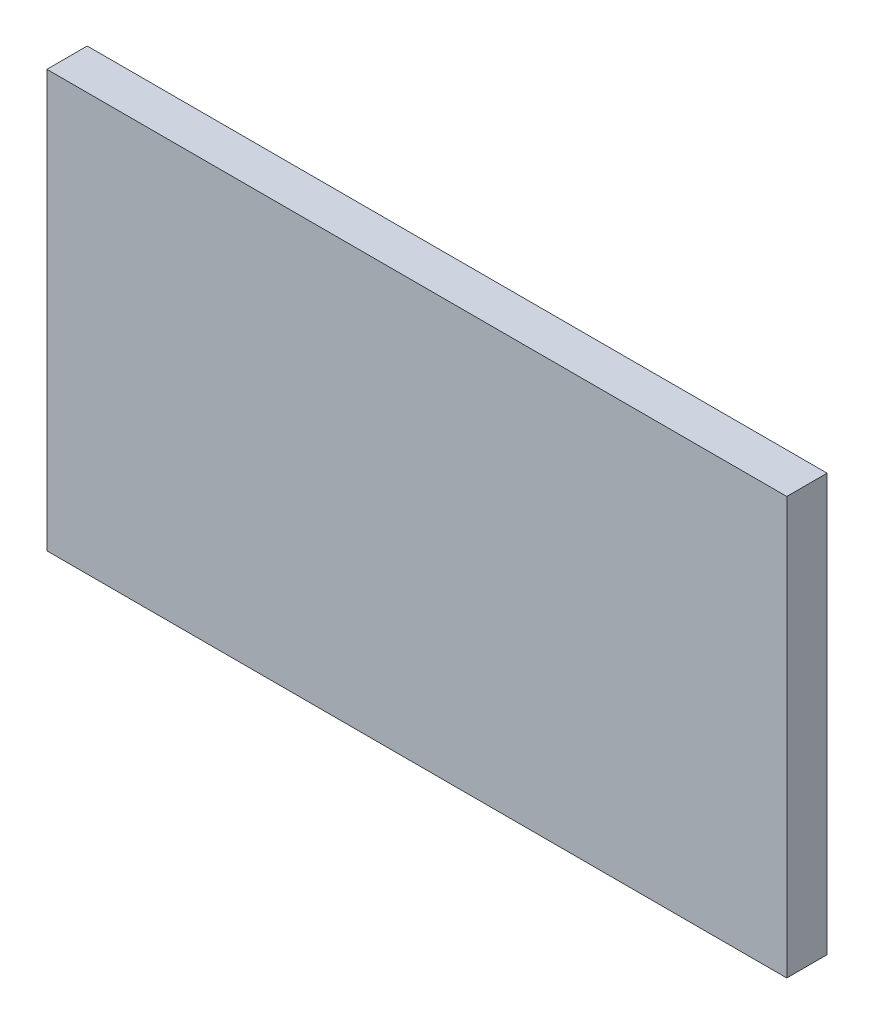
ISO-10303-21;
HEADER;
FILE_DESCRIPTION(('STEP AP214'),'2;1');
FILE_NAME('part.step','',(''),(''),'','','');
FILE_SCHEMA(('AUTOMOTIVE_DESIGN { 1 0 10303 214 1 1 1 1 }'));
ENDSEC;
DATA;
#1=APPLICATION_CONTEXT('core data for automotive mechanical design processes');
#2=APPLICATION_PROTOCOL_DEFINITION('international standard','automotive_design',2000,#1);
#3=PRODUCT_CONTEXT('',#1,'mechanical');
#4=PRODUCT('Part','Part','',(#3));
#5=PRODUCT_RELATED_PRODUCT_CATEGORY('part','',(#4));
#6=PRODUCT_DEFINITION_FORMATION('','',#4);
#7=PRODUCT_DEFINITION_CONTEXT('part definition',#1,'design');
#8=PRODUCT_DEFINITION('design','',#6,#7);
#9=PRODUCT_DEFINITION_SHAPE('','',#8);
#10=(LENGTH_UNIT() NAMED_UNIT(*) SI_UNIT(.MILLI.,.METRE.));
#11=(NAMED_UNIT(*) PLANE_ANGLE_UNIT() SI_UNIT($,.RADIAN.));
#12=(NAMED_UNIT(*) SI_UNIT($,.STERADIAN.) SOLID_ANGLE_UNIT());
#13=UNCERTAINTY_MEASURE_WITH_UNIT(LENGTH_MEASURE(1.E-05),#10,'distance_accuracy_value','');
#14=(GEOMETRIC_REPRESENTATION_CONTEXT(3) GLOBAL_UNCERTAINTY_ASSIGNED_CONTEXT((#13)) GLOBAL_UNIT_ASSIGNED_CONTEXT((#10,
#11,#12)) REPRESENTATION_CONTEXT('',''));
#15=CARTESIAN_POINT('',(0.,0.,0.));
#16=DIRECTION('',(0.,0.,1.));
#17=DIRECTION('',(1.,0.,0.));
#18=AXIS2_PLACEMENT_3D('',#15,#16,#17);
#19=CARTESIAN_POINT('',(106.820407157562,-92.2996991032223,0.762000000007923));
#20=DIRECTION('',(1.,0.,0.));
#21=DIRECTION('',(0.,1.,0.));
#22=AXIS2_PLACEMENT_3D('',#19,#20,#21);
#23=PLANE('',#22);
#24=DIRECTION('',(0.,-1.,0.));
#25=VECTOR('',#24,1.);
#26=CARTESIAN_POINT('',(106.820407157562,-92.299699103209,1.77635683940025E-12));
#27=LINE('',#26,#25);
#28=CARTESIAN_POINT('',(106.820407157562,-84.4256991032124,5.32907051820075E-12));
#29=VERTEX_POINT('',#28);
#30=CARTESIAN_POINT('',(106.820407157562,-92.299699103209,1.77635683940025E-12));
#31=VERTEX_POINT('',#30);
#32=EDGE_CURVE('E97',#29,#31,#27,.T.);
#33=ORIENTED_EDGE('',*,*,#32,.T.);
#34=DIRECTION('',(0.,0.,-1.));
#35=VECTOR('',#34,1.);
#36=CARTESIAN_POINT('',(106.820407157562,-92.2996991032223,0.762000000007923));
#37=LINE('',#36,#35);
#38=CARTESIAN_POINT('',(106.820407157562,-92.2996991032223,0.762000000007923));
#39=VERTEX_POINT('',#38);
#40=EDGE_CURVE('E11',#39,#31,#37,.T.);
#41=ORIENTED_EDGE('',*,*,#40,.F.);
#42=DIRECTION('',(0.,-1.,0.));
#43=VECTOR('',#42,1.);
#44=CARTESIAN_POINT('',(106.820407157562,-92.2996991032223,0.762000000007923));
#45=LINE('',#44,#43);
#46=CARTESIAN_POINT('',(106.820407157562,-84.4256991032062,0.761999999999929));
#47=VERTEX_POINT('',#46);
#48=EDGE_CURVE('E85',#47,#39,#45,.T.);
#49=ORIENTED_EDGE('',*,*,#48,.F.);
#50=DIRECTION('',(0.,0.,-1.));
#51=VECTOR('',#50,1.);
#52=CARTESIAN_POINT('',(106.820407157562,-84.4256991032062,0.761999999999929));
#53=LINE('',#52,#51);
#54=EDGE_CURVE('E93',#47,#29,#53,.T.);
#55=ORIENTED_EDGE('',*,*,#54,.T.);
#56=EDGE_LOOP('',(#33,#41,#49,#55));
#57=FACE_BOUND('',#56,.T.);
#58=ADVANCED_FACE('F34',(#57),#23,.F.);
#59=CARTESIAN_POINT('',(120.790407157562,-92.2996991032135,0.762000000003482));
#60=DIRECTION('',(0.,1.,0.));
#61=DIRECTION('',(0.,0.,1.));
#62=AXIS2_PLACEMENT_3D('',#59,#60,#61);
#63=PLANE('',#62);
#64=DIRECTION('',(1.,0.,0.));
#65=VECTOR('',#64,1.);
#66=CARTESIAN_POINT('',(120.790407157562,-92.2996991032099,8.88178419700125E-13));
#67=LINE('',#66,#65);
#68=CARTESIAN_POINT('',(120.790407157562,-92.2996991032099,8.88178419700125E-13));
#69=VERTEX_POINT('',#68);
#70=EDGE_CURVE('E89',#31,#69,#67,.T.);
#71=ORIENTED_EDGE('',*,*,#70,.T.);
#72=DIRECTION('',(0.,0.,-1.));
#73=VECTOR('',#72,1.);
#74=CARTESIAN_POINT('',(120.790407157562,-92.2996991032135,0.762000000003482));
#75=LINE('',#74,#73);
#76=CARTESIAN_POINT('',(120.790407157562,-92.2996991032135,0.762000000003482));
#77=VERTEX_POINT('',#76);
#78=EDGE_CURVE('E42',#77,#69,#75,.T.);
#79=ORIENTED_EDGE('',*,*,#78,.F.);
#80=DIRECTION('',(1.,0.,0.));
#81=VECTOR('',#80,1.);
#82=CARTESIAN_POINT('',(120.790407157562,-92.2996991032135,0.762000000003482));
#83=LINE('',#82,#81);
#84=EDGE_CURVE('E80',#39,#77,#83,.T.);
#85=ORIENTED_EDGE('',*,*,#84,.F.);
#86=ORIENTED_EDGE('',*,*,#40,.T.);
#87=EDGE_LOOP('',(#71,#79,#85,#86));
#88=FACE_BOUND('',#87,.T.);
#89=ADVANCED_FACE('F88',(#88),#63,.F.);
#90=CARTESIAN_POINT('',(120.790407157562,-92.2996991032135,0.762000000003482));
#91=DIRECTION('',(-1.,0.,0.));
#92=DIRECTION('',(0.,0.,1.));
#93=AXIS2_PLACEMENT_3D('',#90,#91,#92);
#94=PLANE('',#93);
#95=DIRECTION('',(0.,1.,0.));
#96=VECTOR('',#95,1.);
#97=CARTESIAN_POINT('',(120.790407157562,-92.2996991032099,8.88178419700125E-13));
#98=LINE('',#97,#96);
#99=CARTESIAN_POINT('',(120.790407157562,-84.4256991032124,5.32907051820075E-12));
#100=VERTEX_POINT('',#99);
#101=EDGE_CURVE('E67',#69,#100,#98,.T.);
#102=ORIENTED_EDGE('',*,*,#101,.T.);
#103=DIRECTION('',(0.,0.,-1.));
#104=VECTOR('',#103,1.);
#105=CARTESIAN_POINT('',(120.790407157562,-84.4256991032035,0.762000000000818));
#106=LINE('',#105,#104);
#107=CARTESIAN_POINT('',(120.790407157562,-84.4256991032035,0.762000000000818));
#108=VERTEX_POINT('',#107);
#109=EDGE_CURVE('E90',#108,#100,#106,.T.);
#110=ORIENTED_EDGE('',*,*,#109,.F.);
#111=DIRECTION('',(0.,1.,0.));
#112=VECTOR('',#111,1.);
#113=CARTESIAN_POINT('',(120.790407157562,-92.2996991032135,0.762000000003482));
#114=LINE('',#113,#112);
#115=EDGE_CURVE('E83',#77,#108,#114,.T.);
#116=ORIENTED_EDGE('',*,*,#115,.F.);
#117=ORIENTED_EDGE('',*,*,#78,.T.);
#118=EDGE_LOOP('',(#102,#110,#116,#117));
#119=FACE_BOUND('',#118,.T.);
#120=ADVANCED_FACE('F91',(#119),#94,.F.);
#121=CARTESIAN_POINT('',(120.790407157562,-84.4256991032035,0.762000000000818));
#122=DIRECTION('',(0.,-1.,0.));
#123=DIRECTION('',(0.,0.,-1.));
#124=AXIS2_PLACEMENT_3D('',#121,#122,#123);
#125=PLANE('',#124);
#126=DIRECTION('',(-1.,0.,0.));
#127=VECTOR('',#126,1.);
#128=CARTESIAN_POINT('',(120.790407157562,-84.4256991032124,5.32907051820075E-12));
#129=LINE('',#128,#127);
#130=EDGE_CURVE('E73',#100,#29,#129,.T.);
#131=ORIENTED_EDGE('',*,*,#130,.T.);
#132=ORIENTED_EDGE('',*,*,#54,.F.);
#133=DIRECTION('',(-1.,0.,0.));
#134=VECTOR('',#133,1.);
#135=CARTESIAN_POINT('',(120.790407157562,-84.4256991032035,0.762000000000818));
#136=LINE('',#135,#134);
#137=EDGE_CURVE('E50',#108,#47,#136,.T.);
#138=ORIENTED_EDGE('',*,*,#137,.F.);
#139=ORIENTED_EDGE('',*,*,#109,.T.);
#140=EDGE_LOOP('',(#131,#132,#138,#139));
#141=FACE_BOUND('',#140,.T.);
#142=ADVANCED_FACE('F104',(#141),#125,.F.);
#143=CARTESIAN_POINT('',(0.,-6.66133814775094E-13,0.761999999996377));
#144=DIRECTION('',(0.,0.,1.));
#145=DIRECTION('',(1.,0.,0.));
#146=AXIS2_PLACEMENT_3D('',#143,#144,#145);
#147=PLANE('',#146);
#148=ORIENTED_EDGE('',*,*,#48,.T.);
#149=ORIENTED_EDGE('',*,*,#84,.T.);
#150=ORIENTED_EDGE('',*,*,#115,.T.);
#151=ORIENTED_EDGE('',*,*,#137,.T.);
#152=EDGE_LOOP('',(#148,#149,#150,#151));
#153=FACE_BOUND('',#152,.T.);
#154=ADVANCED_FACE('F81',(#153),#147,.T.);
#155=CARTESIAN_POINT('',(0.,0.,0.));
#156=DIRECTION('',(0.,0.,1.));
#157=DIRECTION('',(1.,0.,0.));
#158=AXIS2_PLACEMENT_3D('',#155,#156,#157);
#159=PLANE('',#158);
#160=ORIENTED_EDGE('',*,*,#32,.F.);
#161=ORIENTED_EDGE('',*,*,#130,.F.);
#162=ORIENTED_EDGE('',*,*,#101,.F.);
#163=ORIENTED_EDGE('',*,*,#70,.F.);
#164=EDGE_LOOP('',(#160,#161,#162,#163));
#165=FACE_BOUND('',#164,.T.);
#166=ADVANCED_FACE('F107',(#165),#159,.F.);
#167=CLOSED_SHELL('',(#58,#89,#120,#142,#154,#166));
#168=MANIFOLD_SOLID_BREP('B2',#167);
#169=ADVANCED_BREP_SHAPE_REPRESENTATION('',(#18,#168),#14);
#170=SHAPE_DEFINITION_REPRESENTATION(#9,#169);
ENDSEC;
END-ISO-10303-21;
